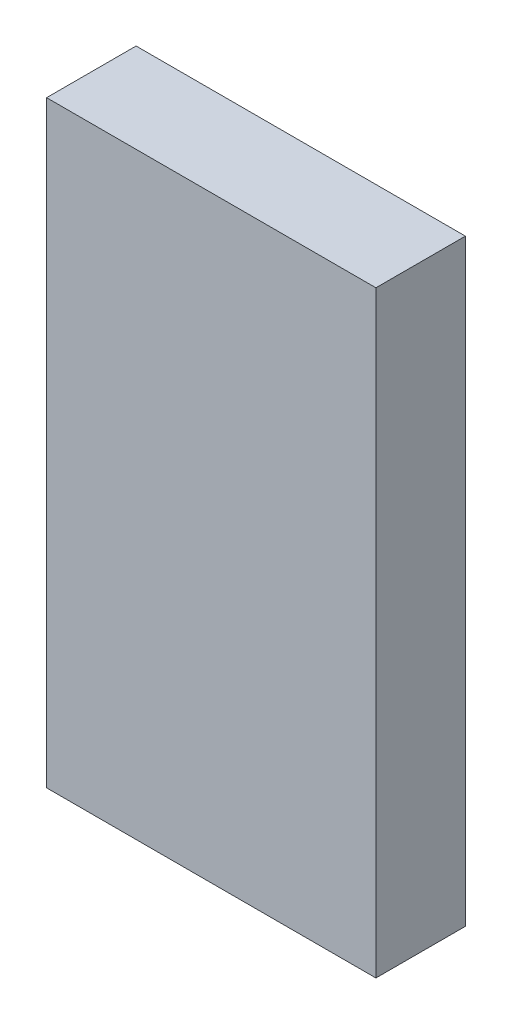
ISO-10303-21;
HEADER;
FILE_DESCRIPTION(('STEP AP214'),'2;1');
FILE_NAME('part.step','',(''),(''),'','','');
FILE_SCHEMA(('AUTOMOTIVE_DESIGN { 1 0 10303 214 1 1 1 1 }'));
ENDSEC;
DATA;
#1=APPLICATION_CONTEXT('core data for automotive mechanical design processes');
#2=APPLICATION_PROTOCOL_DEFINITION('international standard','automotive_design',2000,#1);
#3=PRODUCT_CONTEXT('',#1,'mechanical');
#4=PRODUCT('Part','Part','',(#3));
#5=PRODUCT_RELATED_PRODUCT_CATEGORY('part','',(#4));
#6=PRODUCT_DEFINITION_FORMATION('','',#4);
#7=PRODUCT_DEFINITION_CONTEXT('part definition',#1,'design');
#8=PRODUCT_DEFINITION('design','',#6,#7);
#9=PRODUCT_DEFINITION_SHAPE('','',#8);
#10=(LENGTH_UNIT() NAMED_UNIT(*) SI_UNIT(.MILLI.,.METRE.));
#11=(NAMED_UNIT(*) PLANE_ANGLE_UNIT() SI_UNIT($,.RADIAN.));
#12=(NAMED_UNIT(*) SI_UNIT($,.STERADIAN.) SOLID_ANGLE_UNIT());
#13=UNCERTAINTY_MEASURE_WITH_UNIT(LENGTH_MEASURE(1.E-05),#10,'distance_accuracy_value','');
#14=(GEOMETRIC_REPRESENTATION_CONTEXT(3) GLOBAL_UNCERTAINTY_ASSIGNED_CONTEXT((#13)) GLOBAL_UNIT_ASSIGNED_CONTEXT((#10,
#11,#12)) REPRESENTATION_CONTEXT('',''));
#15=CARTESIAN_POINT('',(0.,0.,0.));
#16=DIRECTION('',(0.,0.,1.));
#17=DIRECTION('',(1.,0.,0.));
#18=AXIS2_PLACEMENT_3D('',#15,#16,#17);
#19=CARTESIAN_POINT('',(0.146,-1.439,0.));
#20=DIRECTION('',(1.,0.,0.));
#21=DIRECTION('',(0.,0.,1.));
#22=AXIS2_PLACEMENT_3D('',#19,#20,#21);
#23=PLANE('',#22);
#24=DIRECTION('',(0.,1.,0.));
#25=VECTOR('',#24,1.);
#26=CARTESIAN_POINT('',(0.146,-1.439,0.1));
#27=LINE('',#26,#25);
#28=CARTESIAN_POINT('',(0.146,-1.439,0.1));
#29=VERTEX_POINT('',#28);
#30=CARTESIAN_POINT('',(0.146,-0.771,0.1));
#31=VERTEX_POINT('',#30);
#32=EDGE_CURVE('E11',#29,#31,#27,.T.);
#33=ORIENTED_EDGE('',*,*,#32,.T.);
#34=DIRECTION('',(0.,0.,1.));
#35=VECTOR('',#34,1.);
#36=CARTESIAN_POINT('',(0.146,-0.771,0.));
#37=LINE('',#36,#35);
#38=CARTESIAN_POINT('',(0.146,-0.771,0.));
#39=VERTEX_POINT('',#38);
#40=EDGE_CURVE('E24',#39,#31,#37,.T.);
#41=ORIENTED_EDGE('',*,*,#40,.F.);
#42=DIRECTION('',(0.,1.,0.));
#43=VECTOR('',#42,1.);
#44=CARTESIAN_POINT('',(0.146,-1.439,0.));
#45=LINE('',#44,#43);
#46=CARTESIAN_POINT('',(0.146,-1.439,0.));
#47=VERTEX_POINT('',#46);
#48=EDGE_CURVE('E86',#47,#39,#45,.T.);
#49=ORIENTED_EDGE('',*,*,#48,.F.);
#50=DIRECTION('',(0.,0.,1.));
#51=VECTOR('',#50,1.);
#52=CARTESIAN_POINT('',(0.146,-1.439,0.));
#53=LINE('',#52,#51);
#54=EDGE_CURVE('E36',#47,#29,#53,.T.);
#55=ORIENTED_EDGE('',*,*,#54,.T.);
#56=EDGE_LOOP('',(#33,#41,#49,#55));
#57=FACE_BOUND('',#56,.T.);
#58=ADVANCED_FACE('F17',(#57),#23,.F.);
#59=CARTESIAN_POINT('',(0.514,-1.439,0.));
#60=DIRECTION('',(1.,0.,0.));
#61=DIRECTION('',(0.,0.,1.));
#62=AXIS2_PLACEMENT_3D('',#59,#60,#61);
#63=PLANE('',#62);
#64=DIRECTION('',(0.,0.,1.));
#65=VECTOR('',#64,1.);
#66=CARTESIAN_POINT('',(0.514,-1.439,0.));
#67=LINE('',#66,#65);
#68=CARTESIAN_POINT('',(0.514,-1.439,0.));
#69=VERTEX_POINT('',#68);
#70=CARTESIAN_POINT('',(0.514,-1.439,0.1));
#71=VERTEX_POINT('',#70);
#72=EDGE_CURVE('E83',#69,#71,#67,.T.);
#73=ORIENTED_EDGE('',*,*,#72,.F.);
#74=DIRECTION('',(0.,1.,0.));
#75=VECTOR('',#74,1.);
#76=CARTESIAN_POINT('',(0.514,-1.439,0.));
#77=LINE('',#76,#75);
#78=CARTESIAN_POINT('',(0.514,-0.771,0.));
#79=VERTEX_POINT('',#78);
#80=EDGE_CURVE('E63',#69,#79,#77,.T.);
#81=ORIENTED_EDGE('',*,*,#80,.T.);
#82=DIRECTION('',(0.,0.,1.));
#83=VECTOR('',#82,1.);
#84=CARTESIAN_POINT('',(0.514,-0.771,0.));
#85=LINE('',#84,#83);
#86=CARTESIAN_POINT('',(0.514,-0.771,0.1));
#87=VERTEX_POINT('',#86);
#88=EDGE_CURVE('E57',#79,#87,#85,.T.);
#89=ORIENTED_EDGE('',*,*,#88,.T.);
#90=DIRECTION('',(0.,1.,0.));
#91=VECTOR('',#90,1.);
#92=CARTESIAN_POINT('',(0.514,-1.439,0.1));
#93=LINE('',#92,#91);
#94=EDGE_CURVE('E60',#71,#87,#93,.T.);
#95=ORIENTED_EDGE('',*,*,#94,.F.);
#96=EDGE_LOOP('',(#73,#81,#89,#95));
#97=FACE_BOUND('',#96,.T.);
#98=ADVANCED_FACE('F59',(#97),#63,.T.);
#99=CARTESIAN_POINT('',(0.146,-1.439,0.));
#100=DIRECTION('',(0.,1.,0.));
#101=DIRECTION('',(0.,0.,1.));
#102=AXIS2_PLACEMENT_3D('',#99,#100,#101);
#103=PLANE('',#102);
#104=ORIENTED_EDGE('',*,*,#72,.T.);
#105=DIRECTION('',(1.,0.,0.));
#106=VECTOR('',#105,1.);
#107=CARTESIAN_POINT('',(0.146,-1.439,0.1));
#108=LINE('',#107,#106);
#109=EDGE_CURVE('E71',#29,#71,#108,.T.);
#110=ORIENTED_EDGE('',*,*,#109,.F.);
#111=ORIENTED_EDGE('',*,*,#54,.F.);
#112=DIRECTION('',(1.,0.,0.));
#113=VECTOR('',#112,1.);
#114=CARTESIAN_POINT('',(0.146,-1.439,0.));
#115=LINE('',#114,#113);
#116=EDGE_CURVE('E76',#47,#69,#115,.T.);
#117=ORIENTED_EDGE('',*,*,#116,.T.);
#118=EDGE_LOOP('',(#104,#110,#111,#117));
#119=FACE_BOUND('',#118,.T.);
#120=ADVANCED_FACE('F91',(#119),#103,.F.);
#121=CARTESIAN_POINT('',(0.146,-0.771,0.));
#122=DIRECTION('',(0.,1.,0.));
#123=DIRECTION('',(0.,0.,1.));
#124=AXIS2_PLACEMENT_3D('',#121,#122,#123);
#125=PLANE('',#124);
#126=DIRECTION('',(1.,0.,0.));
#127=VECTOR('',#126,1.);
#128=CARTESIAN_POINT('',(0.146,-0.771,0.));
#129=LINE('',#128,#127);
#130=EDGE_CURVE('E74',#39,#79,#129,.T.);
#131=ORIENTED_EDGE('',*,*,#130,.F.);
#132=ORIENTED_EDGE('',*,*,#40,.T.);
#133=DIRECTION('',(1.,0.,0.));
#134=VECTOR('',#133,1.);
#135=CARTESIAN_POINT('',(0.146,-0.771,0.1));
#136=LINE('',#135,#134);
#137=EDGE_CURVE('E69',#31,#87,#136,.T.);
#138=ORIENTED_EDGE('',*,*,#137,.T.);
#139=ORIENTED_EDGE('',*,*,#88,.F.);
#140=EDGE_LOOP('',(#131,#132,#138,#139));
#141=FACE_BOUND('',#140,.T.);
#142=ADVANCED_FACE('F73',(#141),#125,.T.);
#143=CARTESIAN_POINT('',(0.146,-1.439,0.));
#144=DIRECTION('',(0.,0.,1.));
#145=DIRECTION('',(1.,0.,0.));
#146=AXIS2_PLACEMENT_3D('',#143,#144,#145);
#147=PLANE('',#146);
#148=ORIENTED_EDGE('',*,*,#130,.T.);
#149=ORIENTED_EDGE('',*,*,#80,.F.);
#150=ORIENTED_EDGE('',*,*,#116,.F.);
#151=ORIENTED_EDGE('',*,*,#48,.T.);
#152=EDGE_LOOP('',(#148,#149,#150,#151));
#153=FACE_BOUND('',#152,.T.);
#154=ADVANCED_FACE('F89',(#153),#147,.F.);
#155=CARTESIAN_POINT('',(0.146,-1.439,0.1));
#156=DIRECTION('',(0.,0.,1.));
#157=DIRECTION('',(1.,0.,0.));
#158=AXIS2_PLACEMENT_3D('',#155,#156,#157);
#159=PLANE('',#158);
#160=ORIENTED_EDGE('',*,*,#32,.F.);
#161=ORIENTED_EDGE('',*,*,#109,.T.);
#162=ORIENTED_EDGE('',*,*,#94,.T.);
#163=ORIENTED_EDGE('',*,*,#137,.F.);
#164=EDGE_LOOP('',(#160,#161,#162,#163));
#165=FACE_BOUND('',#164,.T.);
#166=ADVANCED_FACE('F68',(#165),#159,.T.);
#167=CLOSED_SHELL('',(#58,#98,#120,#142,#154,#166));
#168=MANIFOLD_SOLID_BREP('B1',#167);
#169=ADVANCED_BREP_SHAPE_REPRESENTATION('',(#18,#168),#14);
#170=SHAPE_DEFINITION_REPRESENTATION(#9,#169);
ENDSEC;
END-ISO-10303-21;
